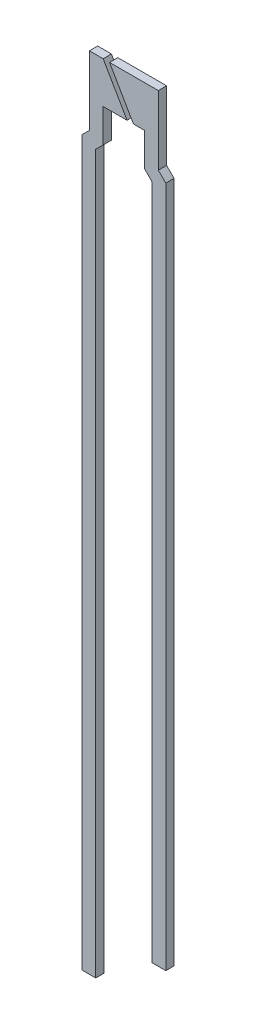
ISO-10303-21;
HEADER;
FILE_DESCRIPTION(('STEP AP214'),'2;1');
FILE_NAME('part.step','',(''),(''),'','','');
FILE_SCHEMA(('AUTOMOTIVE_DESIGN { 1 0 10303 214 1 1 1 1 }'));
ENDSEC;
DATA;
#1=APPLICATION_CONTEXT('core data for automotive mechanical design processes');
#2=APPLICATION_PROTOCOL_DEFINITION('international standard','automotive_design',2000,#1);
#3=PRODUCT_CONTEXT('',#1,'mechanical');
#4=PRODUCT('Part','Part','',(#3));
#5=PRODUCT_RELATED_PRODUCT_CATEGORY('part','',(#4));
#6=PRODUCT_DEFINITION_FORMATION('','',#4);
#7=PRODUCT_DEFINITION_CONTEXT('part definition',#1,'design');
#8=PRODUCT_DEFINITION('design','',#6,#7);
#9=PRODUCT_DEFINITION_SHAPE('','',#8);
#10=(LENGTH_UNIT() NAMED_UNIT(*) SI_UNIT(.MILLI.,.METRE.));
#11=(NAMED_UNIT(*) PLANE_ANGLE_UNIT() SI_UNIT($,.RADIAN.));
#12=(NAMED_UNIT(*) SI_UNIT($,.STERADIAN.) SOLID_ANGLE_UNIT());
#13=UNCERTAINTY_MEASURE_WITH_UNIT(LENGTH_MEASURE(1.E-05),#10,'distance_accuracy_value','');
#14=(GEOMETRIC_REPRESENTATION_CONTEXT(3) GLOBAL_UNCERTAINTY_ASSIGNED_CONTEXT((#13)) GLOBAL_UNIT_ASSIGNED_CONTEXT((#10,
#11,#12)) REPRESENTATION_CONTEXT('',''));
#15=CARTESIAN_POINT('',(0.,0.,0.));
#16=DIRECTION('',(0.,0.,1.));
#17=DIRECTION('',(1.,0.,0.));
#18=AXIS2_PLACEMENT_3D('',#15,#16,#17);
#19=CARTESIAN_POINT('',(-1.02000000000161,-0.977106781188162,0.15));
#20=DIRECTION('',(-0.707106781186551,0.707106781186544,0.));
#21=DIRECTION('',(-0.707106781186544,-0.707106781186551,0.));
#22=AXIS2_PLACEMENT_3D('',#19,#20,#21);
#23=PLANE('',#22);
#24=DIRECTION('',(0.707106781186544,0.707106781186551,0.));
#25=VECTOR('',#24,1.);
#26=CARTESIAN_POINT('',(-1.02000000000161,-0.977106781188162,-0.15));
#27=LINE('',#26,#25);
#28=CARTESIAN_POINT('',(-1.02000000000161,-0.977106781188162,-0.15));
#29=VERTEX_POINT('',#28);
#30=CARTESIAN_POINT('',(-0.75,-0.707106781186546,-0.15));
#31=VERTEX_POINT('',#30);
#32=EDGE_CURVE('E151',#29,#31,#27,.T.);
#33=ORIENTED_EDGE('',*,*,#32,.T.);
#34=DIRECTION('',(0.,0.,-1.));
#35=VECTOR('',#34,1.);
#36=CARTESIAN_POINT('',(-0.75,-0.707106781186546,0.15));
#37=LINE('',#36,#35);
#38=CARTESIAN_POINT('',(-0.75,-0.707106781186546,0.15));
#39=VERTEX_POINT('',#38);
#40=EDGE_CURVE('E12',#39,#31,#37,.T.);
#41=ORIENTED_EDGE('',*,*,#40,.F.);
#42=DIRECTION('',(0.707106781186544,0.707106781186551,0.));
#43=VECTOR('',#42,1.);
#44=CARTESIAN_POINT('',(-1.02000000000161,-0.977106781188162,0.15));
#45=LINE('',#44,#43);
#46=CARTESIAN_POINT('',(-1.02000000000161,-0.977106781188162,0.15));
#47=VERTEX_POINT('',#46);
#48=EDGE_CURVE('E170',#47,#39,#45,.T.);
#49=ORIENTED_EDGE('',*,*,#48,.F.);
#50=DIRECTION('',(0.,0.,-1.));
#51=VECTOR('',#50,1.);
#52=CARTESIAN_POINT('',(-1.02000000000161,-0.977106781188162,0.15));
#53=LINE('',#52,#51);
#54=EDGE_CURVE('E147',#47,#29,#53,.T.);
#55=ORIENTED_EDGE('',*,*,#54,.T.);
#56=EDGE_LOOP('',(#33,#41,#49,#55));
#57=FACE_BOUND('',#56,.T.);
#58=ADVANCED_FACE('F43',(#57),#23,.F.);
#59=CARTESIAN_POINT('',(-0.75,-0.707106781186546,0.15));
#60=DIRECTION('',(-1.,0.,0.));
#61=DIRECTION('',(0.,-1.,0.));
#62=AXIS2_PLACEMENT_3D('',#59,#60,#61);
#63=PLANE('',#62);
#64=DIRECTION('',(0.,1.,0.));
#65=VECTOR('',#64,1.);
#66=CARTESIAN_POINT('',(-0.75,-0.707106781186546,-0.15));
#67=LINE('',#66,#65);
#68=CARTESIAN_POINT('',(-0.75,0.5,-0.15));
#69=VERTEX_POINT('',#68);
#70=EDGE_CURVE('E154',#31,#69,#67,.T.);
#71=ORIENTED_EDGE('',*,*,#70,.T.);
#72=DIRECTION('',(0.,0.,-1.));
#73=VECTOR('',#72,1.);
#74=CARTESIAN_POINT('',(-0.75,0.5,0.15));
#75=LINE('',#74,#73);
#76=CARTESIAN_POINT('',(-0.75,0.5,0.15));
#77=VERTEX_POINT('',#76);
#78=EDGE_CURVE('E51',#77,#69,#75,.T.);
#79=ORIENTED_EDGE('',*,*,#78,.F.);
#80=DIRECTION('',(0.,1.,0.));
#81=VECTOR('',#80,1.);
#82=CARTESIAN_POINT('',(-0.75,-0.707106781186546,0.15));
#83=LINE('',#82,#81);
#84=EDGE_CURVE('E108',#39,#77,#83,.T.);
#85=ORIENTED_EDGE('',*,*,#84,.F.);
#86=ORIENTED_EDGE('',*,*,#40,.T.);
#87=EDGE_LOOP('',(#71,#79,#85,#86));
#88=FACE_BOUND('',#87,.T.);
#89=ADVANCED_FACE('F218',(#88),#63,.F.);
#90=CARTESIAN_POINT('',(-0.75,0.5,0.15));
#91=DIRECTION('',(0.,1.,0.));
#92=DIRECTION('',(-1.,0.,0.));
#93=AXIS2_PLACEMENT_3D('',#90,#91,#92);
#94=PLANE('',#93);
#95=DIRECTION('',(1.,0.,0.));
#96=VECTOR('',#95,1.);
#97=CARTESIAN_POINT('',(-0.75,0.5,-0.15));
#98=LINE('',#97,#96);
#99=CARTESIAN_POINT('',(0.116025403784449,0.5,-0.15));
#100=VERTEX_POINT('',#99);
#101=EDGE_CURVE('E156',#69,#100,#98,.T.);
#102=ORIENTED_EDGE('',*,*,#101,.T.);
#103=DIRECTION('',(0.,0.,-1.));
#104=VECTOR('',#103,1.);
#105=CARTESIAN_POINT('',(0.116025403784449,0.5,0.15));
#106=LINE('',#105,#104);
#107=CARTESIAN_POINT('',(0.116025403784449,0.5,0.15));
#108=VERTEX_POINT('',#107);
#109=EDGE_CURVE('E183',#108,#100,#106,.T.);
#110=ORIENTED_EDGE('',*,*,#109,.F.);
#111=DIRECTION('',(1.,0.,0.));
#112=VECTOR('',#111,1.);
#113=CARTESIAN_POINT('',(-0.75,0.5,0.15));
#114=LINE('',#113,#112);
#115=EDGE_CURVE('E191',#77,#108,#114,.T.);
#116=ORIENTED_EDGE('',*,*,#115,.F.);
#117=ORIENTED_EDGE('',*,*,#78,.T.);
#118=EDGE_LOOP('',(#102,#110,#116,#117));
#119=FACE_BOUND('',#118,.T.);
#120=ADVANCED_FACE('F189',(#119),#94,.F.);
#121=CARTESIAN_POINT('',(0.116025403784449,0.5,0.15));
#122=DIRECTION('',(-0.866025403784436,-0.500000000000005,0.));
#123=DIRECTION('',(0.500000000000005,-0.866025403784436,0.));
#124=AXIS2_PLACEMENT_3D('',#121,#122,#123);
#125=PLANE('',#124);
#126=DIRECTION('',(-0.500000000000005,0.866025403784436,0.));
#127=VECTOR('',#126,1.);
#128=CARTESIAN_POINT('',(0.116025403784449,0.5,-0.15));
#129=LINE('',#128,#127);
#130=CARTESIAN_POINT('',(-0.75,2.,-0.15));
#131=VERTEX_POINT('',#130);
#132=EDGE_CURVE('E158',#100,#131,#129,.T.);
#133=ORIENTED_EDGE('',*,*,#132,.T.);
#134=DIRECTION('',(0.,0.,-1.));
#135=VECTOR('',#134,1.);
#136=CARTESIAN_POINT('',(-0.75,2.,0.15));
#137=LINE('',#136,#135);
#138=CARTESIAN_POINT('',(-0.75,2.,0.15));
#139=VERTEX_POINT('',#138);
#140=EDGE_CURVE('E180',#139,#131,#137,.T.);
#141=ORIENTED_EDGE('',*,*,#140,.F.);
#142=DIRECTION('',(-0.500000000000005,0.866025403784436,0.));
#143=VECTOR('',#142,1.);
#144=CARTESIAN_POINT('',(0.116025403784449,0.5,0.15));
#145=LINE('',#144,#143);
#146=EDGE_CURVE('E208',#108,#139,#145,.T.);
#147=ORIENTED_EDGE('',*,*,#146,.F.);
#148=ORIENTED_EDGE('',*,*,#109,.T.);
#149=EDGE_LOOP('',(#133,#141,#147,#148));
#150=FACE_BOUND('',#149,.T.);
#151=ADVANCED_FACE('F199',(#150),#125,.F.);
#152=CARTESIAN_POINT('',(-0.75,2.,0.15));
#153=DIRECTION('',(0.,-1.,0.));
#154=DIRECTION('',(0.,0.,-1.));
#155=AXIS2_PLACEMENT_3D('',#152,#153,#154);
#156=PLANE('',#155);
#157=DIRECTION('',(-1.,0.,0.));
#158=VECTOR('',#157,1.);
#159=CARTESIAN_POINT('',(-0.75,2.,-0.15));
#160=LINE('',#159,#158);
#161=CARTESIAN_POINT('',(-1.25,2.,-0.15));
#162=VERTEX_POINT('',#161);
#163=EDGE_CURVE('E160',#131,#162,#160,.T.);
#164=ORIENTED_EDGE('',*,*,#163,.T.);
#165=DIRECTION('',(0.,0.,-1.));
#166=VECTOR('',#165,1.);
#167=CARTESIAN_POINT('',(-1.25,2.,0.15));
#168=LINE('',#167,#166);
#169=CARTESIAN_POINT('',(-1.25,2.,0.15));
#170=VERTEX_POINT('',#169);
#171=EDGE_CURVE('E177',#170,#162,#168,.T.);
#172=ORIENTED_EDGE('',*,*,#171,.F.);
#173=DIRECTION('',(-1.,0.,0.));
#174=VECTOR('',#173,1.);
#175=CARTESIAN_POINT('',(-0.75,2.,0.15));
#176=LINE('',#175,#174);
#177=EDGE_CURVE('E205',#139,#170,#176,.T.);
#178=ORIENTED_EDGE('',*,*,#177,.F.);
#179=ORIENTED_EDGE('',*,*,#140,.T.);
#180=EDGE_LOOP('',(#164,#172,#178,#179));
#181=FACE_BOUND('',#180,.T.);
#182=ADVANCED_FACE('F203',(#181),#156,.F.);
#183=CARTESIAN_POINT('',(-1.25,-0.5,0.15));
#184=DIRECTION('',(1.,0.,0.));
#185=DIRECTION('',(0.,1.,0.));
#186=AXIS2_PLACEMENT_3D('',#183,#184,#185);
#187=PLANE('',#186);
#188=DIRECTION('',(0.,-1.,0.));
#189=VECTOR('',#188,1.);
#190=CARTESIAN_POINT('',(-1.25,-0.5,-0.15));
#191=LINE('',#190,#189);
#192=CARTESIAN_POINT('',(-1.25,-0.5,-0.15));
#193=VERTEX_POINT('',#192);
#194=EDGE_CURVE('E163',#162,#193,#191,.T.);
#195=ORIENTED_EDGE('',*,*,#194,.T.);
#196=DIRECTION('',(0.,0.,-1.));
#197=VECTOR('',#196,1.);
#198=CARTESIAN_POINT('',(-1.25,-0.5,0.15));
#199=LINE('',#198,#197);
#200=CARTESIAN_POINT('',(-1.25,-0.5,0.15));
#201=VERTEX_POINT('',#200);
#202=EDGE_CURVE('E174',#201,#193,#199,.T.);
#203=ORIENTED_EDGE('',*,*,#202,.F.);
#204=DIRECTION('',(0.,-1.,0.));
#205=VECTOR('',#204,1.);
#206=CARTESIAN_POINT('',(-1.25,2.,0.15));
#207=LINE('',#206,#205);
#208=EDGE_CURVE('E207',#170,#201,#207,.T.);
#209=ORIENTED_EDGE('',*,*,#208,.F.);
#210=ORIENTED_EDGE('',*,*,#171,.T.);
#211=EDGE_LOOP('',(#195,#203,#209,#210));
#212=FACE_BOUND('',#211,.T.);
#213=ADVANCED_FACE('F230',(#212),#187,.F.);
#214=CARTESIAN_POINT('',(-1.52000000000161,-0.770000000001616,0.15));
#215=DIRECTION('',(0.707106781186552,-0.707106781186543,0.));
#216=DIRECTION('',(0.707106781186543,0.707106781186552,0.));
#217=AXIS2_PLACEMENT_3D('',#214,#215,#216);
#218=PLANE('',#217);
#219=DIRECTION('',(-0.707106781186543,-0.707106781186552,0.));
#220=VECTOR('',#219,1.);
#221=CARTESIAN_POINT('',(-1.52000000000161,-0.770000000001616,-0.15));
#222=LINE('',#221,#220);
#223=CARTESIAN_POINT('',(-1.52000000000161,-0.770000000001616,-0.15));
#224=VERTEX_POINT('',#223);
#225=EDGE_CURVE('E165',#193,#224,#222,.T.);
#226=ORIENTED_EDGE('',*,*,#225,.T.);
#227=DIRECTION('',(0.,0.,-1.));
#228=VECTOR('',#227,1.);
#229=CARTESIAN_POINT('',(-1.52000000000161,-0.770000000001616,0.15));
#230=LINE('',#229,#228);
#231=CARTESIAN_POINT('',(-1.52000000000161,-0.770000000001616,0.15));
#232=VERTEX_POINT('',#231);
#233=EDGE_CURVE('E142',#232,#224,#230,.T.);
#234=ORIENTED_EDGE('',*,*,#233,.F.);
#235=DIRECTION('',(-0.707106781186543,-0.707106781186552,0.));
#236=VECTOR('',#235,1.);
#237=CARTESIAN_POINT('',(-1.52000000000161,-0.770000000001616,0.15));
#238=LINE('',#237,#236);
#239=EDGE_CURVE('E133',#201,#232,#238,.T.);
#240=ORIENTED_EDGE('',*,*,#239,.F.);
#241=ORIENTED_EDGE('',*,*,#202,.T.);
#242=EDGE_LOOP('',(#226,#234,#240,#241));
#243=FACE_BOUND('',#242,.T.);
#244=ADVANCED_FACE('F233',(#243),#218,.F.);
#245=CARTESIAN_POINT('',(-1.52000000000161,-0.770000000001616,0.15));
#246=DIRECTION('',(1.,0.,0.));
#247=DIRECTION('',(0.,0.,-1.));
#248=AXIS2_PLACEMENT_3D('',#245,#246,#247);
#249=PLANE('',#248);
#250=DIRECTION('',(0.,-1.,0.));
#251=VECTOR('',#250,1.);
#252=CARTESIAN_POINT('',(-1.52000000000161,-0.770000000001616,-0.15));
#253=LINE('',#252,#251);
#254=CARTESIAN_POINT('',(-1.52000000000161,-27.0000000000001,-0.15));
#255=VERTEX_POINT('',#254);
#256=EDGE_CURVE('E141',#224,#255,#253,.T.);
#257=ORIENTED_EDGE('',*,*,#256,.T.);
#258=DIRECTION('',(0.,0.,-1.));
#259=VECTOR('',#258,1.);
#260=CARTESIAN_POINT('',(-1.52000000000161,-27.0000000000001,0.15));
#261=LINE('',#260,#259);
#262=CARTESIAN_POINT('',(-1.52000000000161,-27.0000000000001,0.15));
#263=VERTEX_POINT('',#262);
#264=EDGE_CURVE('E138',#263,#255,#261,.T.);
#265=ORIENTED_EDGE('',*,*,#264,.F.);
#266=DIRECTION('',(0.,-1.,0.));
#267=VECTOR('',#266,1.);
#268=CARTESIAN_POINT('',(-1.52000000000161,-0.770000000001616,0.15));
#269=LINE('',#268,#267);
#270=EDGE_CURVE('E127',#232,#263,#269,.T.);
#271=ORIENTED_EDGE('',*,*,#270,.F.);
#272=ORIENTED_EDGE('',*,*,#233,.T.);
#273=EDGE_LOOP('',(#257,#265,#271,#272));
#274=FACE_BOUND('',#273,.T.);
#275=ADVANCED_FACE('F139',(#274),#249,.F.);
#276=CARTESIAN_POINT('',(-1.02000000000161,-27.0000000000001,0.15));
#277=DIRECTION('',(0.,1.,0.));
#278=DIRECTION('',(0.,0.,1.));
#279=AXIS2_PLACEMENT_3D('',#276,#277,#278);
#280=PLANE('',#279);
#281=DIRECTION('',(1.,0.,0.));
#282=VECTOR('',#281,1.);
#283=CARTESIAN_POINT('',(-1.02000000000161,-27.0000000000001,-0.15));
#284=LINE('',#283,#282);
#285=CARTESIAN_POINT('',(-1.02000000000161,-27.0000000000001,-0.15));
#286=VERTEX_POINT('',#285);
#287=EDGE_CURVE('E94',#255,#286,#284,.T.);
#288=ORIENTED_EDGE('',*,*,#287,.T.);
#289=DIRECTION('',(0.,0.,-1.));
#290=VECTOR('',#289,1.);
#291=CARTESIAN_POINT('',(-1.02000000000161,-27.0000000000001,0.15));
#292=LINE('',#291,#290);
#293=CARTESIAN_POINT('',(-1.02000000000161,-27.0000000000001,0.15));
#294=VERTEX_POINT('',#293);
#295=EDGE_CURVE('E143',#294,#286,#292,.T.);
#296=ORIENTED_EDGE('',*,*,#295,.F.);
#297=DIRECTION('',(1.,0.,0.));
#298=VECTOR('',#297,1.);
#299=CARTESIAN_POINT('',(-1.02000000000161,-27.0000000000001,0.15));
#300=LINE('',#299,#298);
#301=EDGE_CURVE('E131',#263,#294,#300,.T.);
#302=ORIENTED_EDGE('',*,*,#301,.F.);
#303=ORIENTED_EDGE('',*,*,#264,.T.);
#304=EDGE_LOOP('',(#288,#296,#302,#303));
#305=FACE_BOUND('',#304,.T.);
#306=ADVANCED_FACE('F145',(#305),#280,.F.);
#307=CARTESIAN_POINT('',(-1.02000000000161,-0.977106781188162,0.15));
#308=DIRECTION('',(-1.,0.,0.));
#309=DIRECTION('',(0.,-1.,0.));
#310=AXIS2_PLACEMENT_3D('',#307,#308,#309);
#311=PLANE('',#310);
#312=DIRECTION('',(0.,1.,0.));
#313=VECTOR('',#312,1.);
#314=CARTESIAN_POINT('',(-1.02000000000161,-0.977106781188162,-0.15));
#315=LINE('',#314,#313);
#316=EDGE_CURVE('E100',#286,#29,#315,.T.);
#317=ORIENTED_EDGE('',*,*,#316,.T.);
#318=ORIENTED_EDGE('',*,*,#54,.F.);
#319=DIRECTION('',(0.,1.,0.));
#320=VECTOR('',#319,1.);
#321=CARTESIAN_POINT('',(-1.02000000000161,-0.977106781188162,0.15));
#322=LINE('',#321,#320);
#323=EDGE_CURVE('E59',#294,#47,#322,.T.);
#324=ORIENTED_EDGE('',*,*,#323,.F.);
#325=ORIENTED_EDGE('',*,*,#295,.T.);
#326=EDGE_LOOP('',(#317,#318,#324,#325));
#327=FACE_BOUND('',#326,.T.);
#328=ADVANCED_FACE('F242',(#327),#311,.F.);
#329=CARTESIAN_POINT('',(0.,0.,0.15));
#330=DIRECTION('',(0.,0.,1.));
#331=DIRECTION('',(1.,0.,0.));
#332=AXIS2_PLACEMENT_3D('',#329,#330,#331);
#333=PLANE('',#332);
#334=ORIENTED_EDGE('',*,*,#48,.T.);
#335=ORIENTED_EDGE('',*,*,#84,.T.);
#336=ORIENTED_EDGE('',*,*,#115,.T.);
#337=ORIENTED_EDGE('',*,*,#146,.T.);
#338=ORIENTED_EDGE('',*,*,#177,.T.);
#339=ORIENTED_EDGE('',*,*,#208,.T.);
#340=ORIENTED_EDGE('',*,*,#239,.T.);
#341=ORIENTED_EDGE('',*,*,#270,.T.);
#342=ORIENTED_EDGE('',*,*,#301,.T.);
#343=ORIENTED_EDGE('',*,*,#323,.T.);
#344=EDGE_LOOP('',(#334,#335,#336,#337,#338,#339,#340,#341,#342,#343));
#345=FACE_BOUND('',#344,.T.);
#346=ADVANCED_FACE('F129',(#345),#333,.T.);
#347=CARTESIAN_POINT('',(0.,0.,-0.15));
#348=DIRECTION('',(0.,0.,1.));
#349=DIRECTION('',(1.,0.,0.));
#350=AXIS2_PLACEMENT_3D('',#347,#348,#349);
#351=PLANE('',#350);
#352=ORIENTED_EDGE('',*,*,#32,.F.);
#353=ORIENTED_EDGE('',*,*,#316,.F.);
#354=ORIENTED_EDGE('',*,*,#287,.F.);
#355=ORIENTED_EDGE('',*,*,#256,.F.);
#356=ORIENTED_EDGE('',*,*,#225,.F.);
#357=ORIENTED_EDGE('',*,*,#194,.F.);
#358=ORIENTED_EDGE('',*,*,#163,.F.);
#359=ORIENTED_EDGE('',*,*,#132,.F.);
#360=ORIENTED_EDGE('',*,*,#101,.F.);
#361=ORIENTED_EDGE('',*,*,#70,.F.);
#362=EDGE_LOOP('',(#352,#353,#354,#355,#356,#357,#358,#359,#360,#361));
#363=FACE_BOUND('',#362,.T.);
#364=ADVANCED_FACE('F195',(#363),#351,.F.);
#365=CLOSED_SHELL('',(#58,#89,#120,#151,#182,#213,#244,#275,#306,#328,#346,#364));
#366=MANIFOLD_SOLID_BREP('B2',#365);
#367=CARTESIAN_POINT('',(1.52000000000161,-0.770000000001615,0.15));
#368=DIRECTION('',(-1.,0.,0.));
#369=DIRECTION('',(0.,-1.,0.));
#370=AXIS2_PLACEMENT_3D('',#367,#368,#369);
#371=PLANE('',#370);
#372=DIRECTION('',(0.,1.,0.));
#373=VECTOR('',#372,1.);
#374=CARTESIAN_POINT('',(1.52000000000161,-0.770000000001615,-0.15));
#375=LINE('',#374,#373);
#376=CARTESIAN_POINT('',(1.52000000000161,-25.5000000000001,-0.15));
#377=VERTEX_POINT('',#376);
#378=CARTESIAN_POINT('',(1.52000000000161,-0.770000000001615,-0.15));
#379=VERTEX_POINT('',#378);
#380=EDGE_CURVE('E434',#377,#379,#375,.T.);
#381=ORIENTED_EDGE('',*,*,#380,.T.);
#382=DIRECTION('',(0.,0.,-1.));
#383=VECTOR('',#382,1.);
#384=CARTESIAN_POINT('',(1.52000000000161,-0.770000000001615,0.15));
#385=LINE('',#384,#383);
#386=CARTESIAN_POINT('',(1.52000000000161,-0.770000000001615,0.15));
#387=VERTEX_POINT('',#386);
#388=EDGE_CURVE('E41',#387,#379,#385,.T.);
#389=ORIENTED_EDGE('',*,*,#388,.F.);
#390=DIRECTION('',(0.,1.,0.));
#391=VECTOR('',#390,1.);
#392=CARTESIAN_POINT('',(1.52000000000161,-0.770000000001615,0.15));
#393=LINE('',#392,#391);
#394=CARTESIAN_POINT('',(1.52000000000161,-25.5000000000001,0.15));
#395=VERTEX_POINT('',#394);
#396=EDGE_CURVE('E453',#395,#387,#393,.T.);
#397=ORIENTED_EDGE('',*,*,#396,.F.);
#398=DIRECTION('',(0.,0.,-1.));
#399=VECTOR('',#398,1.);
#400=CARTESIAN_POINT('',(1.52000000000161,-25.5000000000001,0.15));
#401=LINE('',#400,#399);
#402=EDGE_CURVE('E430',#395,#377,#401,.T.);
#403=ORIENTED_EDGE('',*,*,#402,.T.);
#404=EDGE_LOOP('',(#381,#389,#397,#403));
#405=FACE_BOUND('',#404,.T.);
#406=ADVANCED_FACE('F326',(#405),#371,.F.);
#407=CARTESIAN_POINT('',(1.52000000000161,-0.770000000001615,0.15));
#408=DIRECTION('',(-0.707106781186551,-0.707106781186544,0.));
#409=DIRECTION('',(0.707106781186544,-0.707106781186551,0.));
#410=AXIS2_PLACEMENT_3D('',#407,#408,#409);
#411=PLANE('',#410);
#412=DIRECTION('',(-0.707106781186544,0.707106781186552,0.));
#413=VECTOR('',#412,1.);
#414=CARTESIAN_POINT('',(1.52000000000161,-0.770000000001615,-0.15));
#415=LINE('',#414,#413);
#416=CARTESIAN_POINT('',(1.25,-0.5,-0.15));
#417=VERTEX_POINT('',#416);
#418=EDGE_CURVE('E437',#379,#417,#415,.T.);
#419=ORIENTED_EDGE('',*,*,#418,.T.);
#420=DIRECTION('',(0.,0.,-1.));
#421=VECTOR('',#420,1.);
#422=CARTESIAN_POINT('',(1.25,-0.5,0.15));
#423=LINE('',#422,#421);
#424=CARTESIAN_POINT('',(1.25,-0.5,0.15));
#425=VERTEX_POINT('',#424);
#426=EDGE_CURVE('E334',#425,#417,#423,.T.);
#427=ORIENTED_EDGE('',*,*,#426,.F.);
#428=DIRECTION('',(-0.707106781186544,0.707106781186552,0.));
#429=VECTOR('',#428,1.);
#430=CARTESIAN_POINT('',(1.52000000000161,-0.770000000001615,0.15));
#431=LINE('',#430,#429);
#432=EDGE_CURVE('E391',#387,#425,#431,.T.);
#433=ORIENTED_EDGE('',*,*,#432,.F.);
#434=ORIENTED_EDGE('',*,*,#388,.T.);
#435=EDGE_LOOP('',(#419,#427,#433,#434));
#436=FACE_BOUND('',#435,.T.);
#437=ADVANCED_FACE('F474',(#436),#411,.F.);
#438=CARTESIAN_POINT('',(1.25,2.,0.15));
#439=DIRECTION('',(-1.,0.,0.));
#440=DIRECTION('',(0.,-1.,0.));
#441=AXIS2_PLACEMENT_3D('',#438,#439,#440);
#442=PLANE('',#441);
#443=DIRECTION('',(0.,1.,0.));
#444=VECTOR('',#443,1.);
#445=CARTESIAN_POINT('',(1.25,2.,-0.15));
#446=LINE('',#445,#444);
#447=CARTESIAN_POINT('',(1.25,2.,-0.15));
#448=VERTEX_POINT('',#447);
#449=EDGE_CURVE('E440',#417,#448,#446,.T.);
#450=ORIENTED_EDGE('',*,*,#449,.T.);
#451=DIRECTION('',(0.,0.,-1.));
#452=VECTOR('',#451,1.);
#453=CARTESIAN_POINT('',(1.25,2.,0.15));
#454=LINE('',#453,#452);
#455=CARTESIAN_POINT('',(1.25,2.,0.15));
#456=VERTEX_POINT('',#455);
#457=EDGE_CURVE('E466',#456,#448,#454,.T.);
#458=ORIENTED_EDGE('',*,*,#457,.F.);
#459=DIRECTION('',(0.,1.,0.));
#460=VECTOR('',#459,1.);
#461=CARTESIAN_POINT('',(1.25,-0.5,0.15));
#462=LINE('',#461,#460);
#463=EDGE_CURVE('E473',#425,#456,#462,.T.);
#464=ORIENTED_EDGE('',*,*,#463,.F.);
#465=ORIENTED_EDGE('',*,*,#426,.T.);
#466=EDGE_LOOP('',(#450,#458,#464,#465));
#467=FACE_BOUND('',#466,.T.);
#468=ADVANCED_FACE('F471',(#467),#442,.F.);
#469=CARTESIAN_POINT('',(-0.519059892324149,2.,0.15));
#470=DIRECTION('',(0.,-1.,0.));
#471=DIRECTION('',(0.,0.,-1.));
#472=AXIS2_PLACEMENT_3D('',#469,#470,#471);
#473=PLANE('',#472);
#474=DIRECTION('',(-1.,0.,0.));
#475=VECTOR('',#474,1.);
#476=CARTESIAN_POINT('',(-0.519059892324149,2.,-0.15));
#477=LINE('',#476,#475);
#478=CARTESIAN_POINT('',(-0.519059892324149,2.,-0.15));
#479=VERTEX_POINT('',#478);
#480=EDGE_CURVE('E442',#448,#479,#477,.T.);
#481=ORIENTED_EDGE('',*,*,#480,.T.);
#482=DIRECTION('',(0.,0.,-1.));
#483=VECTOR('',#482,1.);
#484=CARTESIAN_POINT('',(-0.519059892324149,2.,0.15));
#485=LINE('',#484,#483);
#486=CARTESIAN_POINT('',(-0.519059892324149,2.,0.15));
#487=VERTEX_POINT('',#486);
#488=EDGE_CURVE('E463',#487,#479,#485,.T.);
#489=ORIENTED_EDGE('',*,*,#488,.F.);
#490=DIRECTION('',(-1.,0.,0.));
#491=VECTOR('',#490,1.);
#492=CARTESIAN_POINT('',(-0.519059892324149,2.,0.15));
#493=LINE('',#492,#491);
#494=EDGE_CURVE('E493',#456,#487,#493,.T.);
#495=ORIENTED_EDGE('',*,*,#494,.F.);
#496=ORIENTED_EDGE('',*,*,#457,.T.);
#497=EDGE_LOOP('',(#481,#489,#495,#496));
#498=FACE_BOUND('',#497,.T.);
#499=ADVANCED_FACE('F484',(#498),#473,.F.);
#500=CARTESIAN_POINT('',(0.3469655114603,0.5,0.15));
#501=DIRECTION('',(0.866025403784436,0.500000000000004,0.));
#502=DIRECTION('',(-0.500000000000004,0.866025403784436,0.));
#503=AXIS2_PLACEMENT_3D('',#500,#501,#502);
#504=PLANE('',#503);
#505=DIRECTION('',(0.500000000000004,-0.866025403784436,0.));
#506=VECTOR('',#505,1.);
#507=CARTESIAN_POINT('',(0.3469655114603,0.5,-0.15));
#508=LINE('',#507,#506);
#509=CARTESIAN_POINT('',(0.3469655114603,0.5,-0.15));
#510=VERTEX_POINT('',#509);
#511=EDGE_CURVE('E444',#479,#510,#508,.T.);
#512=ORIENTED_EDGE('',*,*,#511,.T.);
#513=DIRECTION('',(0.,0.,-1.));
#514=VECTOR('',#513,1.);
#515=CARTESIAN_POINT('',(0.3469655114603,0.5,0.15));
#516=LINE('',#515,#514);
#517=CARTESIAN_POINT('',(0.3469655114603,0.5,0.15));
#518=VERTEX_POINT('',#517);
#519=EDGE_CURVE('E460',#518,#510,#516,.T.);
#520=ORIENTED_EDGE('',*,*,#519,.F.);
#521=DIRECTION('',(0.500000000000004,-0.866025403784436,0.));
#522=VECTOR('',#521,1.);
#523=CARTESIAN_POINT('',(0.3469655114603,0.5,0.15));
#524=LINE('',#523,#522);
#525=EDGE_CURVE('E490',#487,#518,#524,.T.);
#526=ORIENTED_EDGE('',*,*,#525,.F.);
#527=ORIENTED_EDGE('',*,*,#488,.T.);
#528=EDGE_LOOP('',(#512,#520,#526,#527));
#529=FACE_BOUND('',#528,.T.);
#530=ADVANCED_FACE('F488',(#529),#504,.F.);
#531=CARTESIAN_POINT('',(0.75,0.5,0.15));
#532=DIRECTION('',(0.,1.,0.));
#533=DIRECTION('',(-1.,0.,0.));
#534=AXIS2_PLACEMENT_3D('',#531,#532,#533);
#535=PLANE('',#534);
#536=DIRECTION('',(1.,0.,0.));
#537=VECTOR('',#536,1.);
#538=CARTESIAN_POINT('',(0.75,0.5,-0.15));
#539=LINE('',#538,#537);
#540=CARTESIAN_POINT('',(0.75,0.5,-0.15));
#541=VERTEX_POINT('',#540);
#542=EDGE_CURVE('E446',#510,#541,#539,.T.);
#543=ORIENTED_EDGE('',*,*,#542,.T.);
#544=DIRECTION('',(0.,0.,-1.));
#545=VECTOR('',#544,1.);
#546=CARTESIAN_POINT('',(0.75,0.5,0.15));
#547=LINE('',#546,#545);
#548=CARTESIAN_POINT('',(0.75,0.5,0.15));
#549=VERTEX_POINT('',#548);
#550=EDGE_CURVE('E457',#549,#541,#547,.T.);
#551=ORIENTED_EDGE('',*,*,#550,.F.);
#552=DIRECTION('',(1.,0.,0.));
#553=VECTOR('',#552,1.);
#554=CARTESIAN_POINT('',(0.75,0.5,0.15));
#555=LINE('',#554,#553);
#556=EDGE_CURVE('E492',#518,#549,#555,.T.);
#557=ORIENTED_EDGE('',*,*,#556,.F.);
#558=ORIENTED_EDGE('',*,*,#519,.T.);
#559=EDGE_LOOP('',(#543,#551,#557,#558));
#560=FACE_BOUND('',#559,.T.);
#561=ADVANCED_FACE('F508',(#560),#535,.F.);
#562=CARTESIAN_POINT('',(0.75,-0.707106781186546,0.15));
#563=DIRECTION('',(1.,0.,0.));
#564=DIRECTION('',(0.,0.,-1.));
#565=AXIS2_PLACEMENT_3D('',#562,#563,#564);
#566=PLANE('',#565);
#567=DIRECTION('',(0.,-1.,0.));
#568=VECTOR('',#567,1.);
#569=CARTESIAN_POINT('',(0.75,-0.707106781186546,-0.15));
#570=LINE('',#569,#568);
#571=CARTESIAN_POINT('',(0.75,-0.707106781186546,-0.15));
#572=VERTEX_POINT('',#571);
#573=EDGE_CURVE('E448',#541,#572,#570,.T.);
#574=ORIENTED_EDGE('',*,*,#573,.T.);
#575=DIRECTION('',(0.,0.,-1.));
#576=VECTOR('',#575,1.);
#577=CARTESIAN_POINT('',(0.75,-0.707106781186546,0.15));
#578=LINE('',#577,#576);
#579=CARTESIAN_POINT('',(0.75,-0.707106781186546,0.15));
#580=VERTEX_POINT('',#579);
#581=EDGE_CURVE('E425',#580,#572,#578,.T.);
#582=ORIENTED_EDGE('',*,*,#581,.F.);
#583=DIRECTION('',(0.,-1.,0.));
#584=VECTOR('',#583,1.);
#585=CARTESIAN_POINT('',(0.75,-0.707106781186546,0.15));
#586=LINE('',#585,#584);
#587=EDGE_CURVE('E416',#549,#580,#586,.T.);
#588=ORIENTED_EDGE('',*,*,#587,.F.);
#589=ORIENTED_EDGE('',*,*,#550,.T.);
#590=EDGE_LOOP('',(#574,#582,#588,#589));
#591=FACE_BOUND('',#590,.T.);
#592=ADVANCED_FACE('F505',(#591),#566,.F.);
#593=CARTESIAN_POINT('',(1.02000000000161,-0.977106781188161,0.15));
#594=DIRECTION('',(0.707106781186551,0.707106781186544,0.));
#595=DIRECTION('',(-0.707106781186544,0.707106781186551,0.));
#596=AXIS2_PLACEMENT_3D('',#593,#594,#595);
#597=PLANE('',#596);
#598=DIRECTION('',(0.707106781186544,-0.707106781186551,0.));
#599=VECTOR('',#598,1.);
#600=CARTESIAN_POINT('',(1.02000000000161,-0.977106781188161,-0.15));
#601=LINE('',#600,#599);
#602=CARTESIAN_POINT('',(1.02000000000161,-0.977106781188161,-0.15));
#603=VERTEX_POINT('',#602);
#604=EDGE_CURVE('E424',#572,#603,#601,.T.);
#605=ORIENTED_EDGE('',*,*,#604,.T.);
#606=DIRECTION('',(0.,0.,-1.));
#607=VECTOR('',#606,1.);
#608=CARTESIAN_POINT('',(1.02000000000161,-0.977106781188161,0.15));
#609=LINE('',#608,#607);
#610=CARTESIAN_POINT('',(1.02000000000161,-0.977106781188161,0.15));
#611=VERTEX_POINT('',#610);
#612=EDGE_CURVE('E421',#611,#603,#609,.T.);
#613=ORIENTED_EDGE('',*,*,#612,.F.);
#614=DIRECTION('',(0.707106781186544,-0.707106781186551,0.));
#615=VECTOR('',#614,1.);
#616=CARTESIAN_POINT('',(1.02000000000161,-0.977106781188161,0.15));
#617=LINE('',#616,#615);
#618=EDGE_CURVE('E410',#580,#611,#617,.T.);
#619=ORIENTED_EDGE('',*,*,#618,.F.);
#620=ORIENTED_EDGE('',*,*,#581,.T.);
#621=EDGE_LOOP('',(#605,#613,#619,#620));
#622=FACE_BOUND('',#621,.T.);
#623=ADVANCED_FACE('F422',(#622),#597,.F.);
#624=CARTESIAN_POINT('',(1.02000000000161,-0.977106781188161,0.15));
#625=DIRECTION('',(1.,0.,0.));
#626=DIRECTION('',(0.,1.,0.));
#627=AXIS2_PLACEMENT_3D('',#624,#625,#626);
#628=PLANE('',#627);
#629=DIRECTION('',(0.,-1.,0.));
#630=VECTOR('',#629,1.);
#631=CARTESIAN_POINT('',(1.02000000000161,-0.977106781188161,-0.15));
#632=LINE('',#631,#630);
#633=CARTESIAN_POINT('',(1.02000000000161,-25.5000000000001,-0.15));
#634=VERTEX_POINT('',#633);
#635=EDGE_CURVE('E377',#603,#634,#632,.T.);
#636=ORIENTED_EDGE('',*,*,#635,.T.);
#637=DIRECTION('',(0.,0.,-1.));
#638=VECTOR('',#637,1.);
#639=CARTESIAN_POINT('',(1.02000000000161,-25.5000000000001,0.15));
#640=LINE('',#639,#638);
#641=CARTESIAN_POINT('',(1.02000000000161,-25.5000000000001,0.15));
#642=VERTEX_POINT('',#641);
#643=EDGE_CURVE('E426',#642,#634,#640,.T.);
#644=ORIENTED_EDGE('',*,*,#643,.F.);
#645=DIRECTION('',(0.,-1.,0.));
#646=VECTOR('',#645,1.);
#647=CARTESIAN_POINT('',(1.02000000000161,-0.977106781188161,0.15));
#648=LINE('',#647,#646);
#649=EDGE_CURVE('E414',#611,#642,#648,.T.);
#650=ORIENTED_EDGE('',*,*,#649,.F.);
#651=ORIENTED_EDGE('',*,*,#612,.T.);
#652=EDGE_LOOP('',(#636,#644,#650,#651));
#653=FACE_BOUND('',#652,.T.);
#654=ADVANCED_FACE('F428',(#653),#628,.F.);
#655=CARTESIAN_POINT('',(1.02000000000161,-25.5000000000001,0.15));
#656=DIRECTION('',(0.,1.,0.));
#657=DIRECTION('',(0.,0.,1.));
#658=AXIS2_PLACEMENT_3D('',#655,#656,#657);
#659=PLANE('',#658);
#660=DIRECTION('',(1.,0.,0.));
#661=VECTOR('',#660,1.);
#662=CARTESIAN_POINT('',(1.02000000000161,-25.5000000000001,-0.15));
#663=LINE('',#662,#661);
#664=EDGE_CURVE('E383',#634,#377,#663,.T.);
#665=ORIENTED_EDGE('',*,*,#664,.T.);
#666=ORIENTED_EDGE('',*,*,#402,.F.);
#667=DIRECTION('',(1.,0.,0.));
#668=VECTOR('',#667,1.);
#669=CARTESIAN_POINT('',(1.02000000000161,-25.5000000000001,0.15));
#670=LINE('',#669,#668);
#671=EDGE_CURVE('E342',#642,#395,#670,.T.);
#672=ORIENTED_EDGE('',*,*,#671,.F.);
#673=ORIENTED_EDGE('',*,*,#643,.T.);
#674=EDGE_LOOP('',(#665,#666,#672,#673));
#675=FACE_BOUND('',#674,.T.);
#676=ADVANCED_FACE('F502',(#675),#659,.F.);
#677=CARTESIAN_POINT('',(0.,0.,0.15));
#678=DIRECTION('',(0.,0.,1.));
#679=DIRECTION('',(1.,0.,0.));
#680=AXIS2_PLACEMENT_3D('',#677,#678,#679);
#681=PLANE('',#680);
#682=ORIENTED_EDGE('',*,*,#396,.T.);
#683=ORIENTED_EDGE('',*,*,#432,.T.);
#684=ORIENTED_EDGE('',*,*,#463,.T.);
#685=ORIENTED_EDGE('',*,*,#494,.T.);
#686=ORIENTED_EDGE('',*,*,#525,.T.);
#687=ORIENTED_EDGE('',*,*,#556,.T.);
#688=ORIENTED_EDGE('',*,*,#587,.T.);
#689=ORIENTED_EDGE('',*,*,#618,.T.);
#690=ORIENTED_EDGE('',*,*,#649,.T.);
#691=ORIENTED_EDGE('',*,*,#671,.T.);
#692=EDGE_LOOP('',(#682,#683,#684,#685,#686,#687,#688,#689,#690,#691));
#693=FACE_BOUND('',#692,.T.);
#694=ADVANCED_FACE('F412',(#693),#681,.T.);
#695=CARTESIAN_POINT('',(0.,0.,-0.15));
#696=DIRECTION('',(0.,0.,1.));
#697=DIRECTION('',(1.,0.,0.));
#698=AXIS2_PLACEMENT_3D('',#695,#696,#697);
#699=PLANE('',#698);
#700=ORIENTED_EDGE('',*,*,#380,.F.);
#701=ORIENTED_EDGE('',*,*,#664,.F.);
#702=ORIENTED_EDGE('',*,*,#635,.F.);
#703=ORIENTED_EDGE('',*,*,#604,.F.);
#704=ORIENTED_EDGE('',*,*,#573,.F.);
#705=ORIENTED_EDGE('',*,*,#542,.F.);
#706=ORIENTED_EDGE('',*,*,#511,.F.);
#707=ORIENTED_EDGE('',*,*,#480,.F.);
#708=ORIENTED_EDGE('',*,*,#449,.F.);
#709=ORIENTED_EDGE('',*,*,#418,.F.);
#710=EDGE_LOOP('',(#700,#701,#702,#703,#704,#705,#706,#707,#708,#709));
#711=FACE_BOUND('',#710,.T.);
#712=ADVANCED_FACE('F478',(#711),#699,.F.);
#713=CLOSED_SHELL('',(#406,#437,#468,#499,#530,#561,#592,#623,#654,#676,#694,#712));
#714=MANIFOLD_SOLID_BREP('B6',#713);
#715=ADVANCED_BREP_SHAPE_REPRESENTATION('',(#18,#366,#714),#14);
#716=SHAPE_DEFINITION_REPRESENTATION(#9,#715);
ENDSEC;
END-ISO-10303-21;
